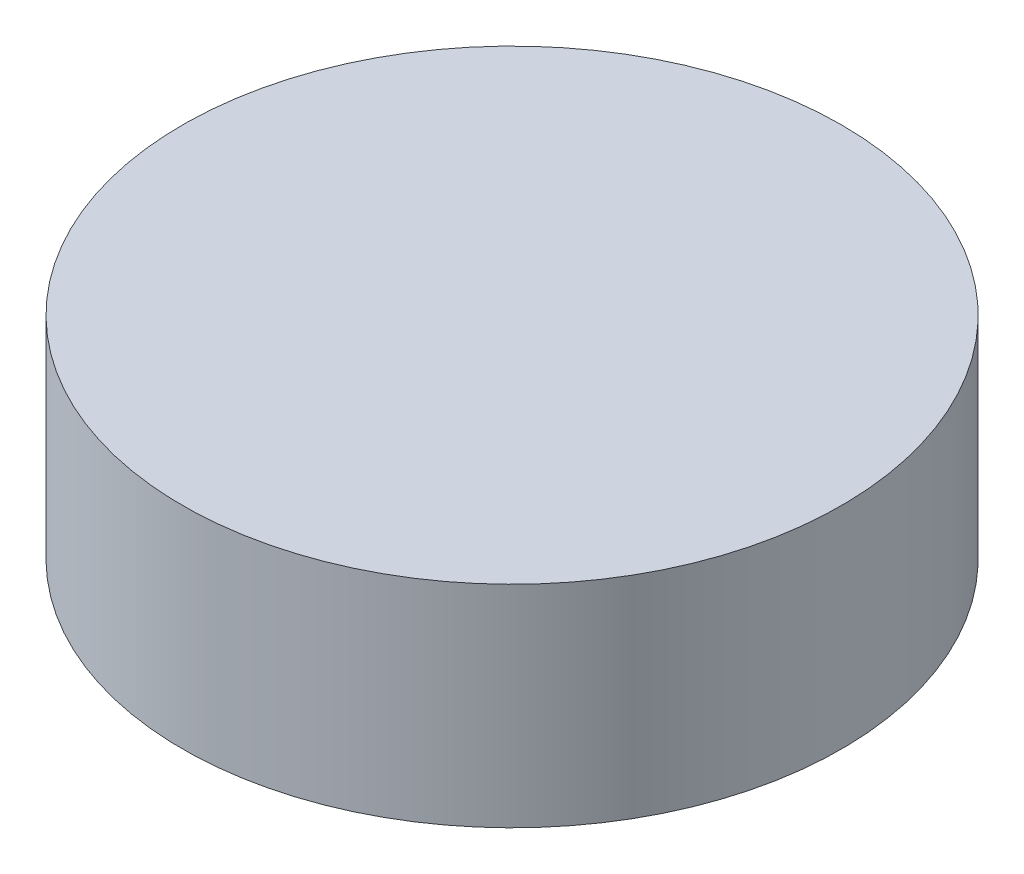
ISO-10303-21;
HEADER;
FILE_DESCRIPTION(('STEP AP214'),'2;1');
FILE_NAME('part.step','',(''),(''),'','','');
FILE_SCHEMA(('AUTOMOTIVE_DESIGN { 1 0 10303 214 1 1 1 1 }'));
ENDSEC;
DATA;
#1=APPLICATION_CONTEXT('core data for automotive mechanical design processes');
#2=APPLICATION_PROTOCOL_DEFINITION('international standard','automotive_design',2000,#1);
#3=PRODUCT_CONTEXT('',#1,'mechanical');
#4=PRODUCT('Part','Part','',(#3));
#5=PRODUCT_RELATED_PRODUCT_CATEGORY('part','',(#4));
#6=PRODUCT_DEFINITION_FORMATION('','',#4);
#7=PRODUCT_DEFINITION_CONTEXT('part definition',#1,'design');
#8=PRODUCT_DEFINITION('design','',#6,#7);
#9=PRODUCT_DEFINITION_SHAPE('','',#8);
#10=(LENGTH_UNIT() NAMED_UNIT(*) SI_UNIT(.MILLI.,.METRE.));
#11=(NAMED_UNIT(*) PLANE_ANGLE_UNIT() SI_UNIT($,.RADIAN.));
#12=(NAMED_UNIT(*) SI_UNIT($,.STERADIAN.) SOLID_ANGLE_UNIT());
#13=UNCERTAINTY_MEASURE_WITH_UNIT(LENGTH_MEASURE(1.E-05),#10,'distance_accuracy_value','');
#14=(GEOMETRIC_REPRESENTATION_CONTEXT(3) GLOBAL_UNCERTAINTY_ASSIGNED_CONTEXT((#13)) GLOBAL_UNIT_ASSIGNED_CONTEXT((#10,
#11,#12)) REPRESENTATION_CONTEXT('',''));
#15=CARTESIAN_POINT('',(0.,0.,0.));
#16=DIRECTION('',(0.,0.,1.));
#17=DIRECTION('',(1.,0.,0.));
#18=AXIS2_PLACEMENT_3D('',#15,#16,#17);
#19=CARTESIAN_POINT('',(0.,0.64,0.));
#20=DIRECTION('',(0.,1.,0.));
#21=DIRECTION('',(0.,0.,1.));
#22=AXIS2_PLACEMENT_3D('',#19,#20,#21);
#23=PLANE('',#22);
#24=CARTESIAN_POINT('',(0.,0.64,0.));
#25=DIRECTION('',(0.,-1.,0.));
#26=DIRECTION('',(0.,0.,-1.));
#27=AXIS2_PLACEMENT_3D('',#24,#25,#26);
#28=CIRCLE('',#27,1.);
#29=CARTESIAN_POINT('',(0.,0.64,-1.));
#30=VERTEX_POINT('',#29);
#31=EDGE_CURVE('E18',#30,#30,#28,.T.);
#32=ORIENTED_EDGE('',*,*,#31,.F.);
#33=EDGE_LOOP('',(#32));
#34=FACE_BOUND('',#33,.T.);
#35=ADVANCED_FACE('F15',(#34),#23,.T.);
#36=CARTESIAN_POINT('',(0.,3.468427124746,0.));
#37=DIRECTION('',(0.,-1.,0.));
#38=DIRECTION('',(0.,0.,-1.));
#39=AXIS2_PLACEMENT_3D('',#36,#37,#38);
#40=CYLINDRICAL_SURFACE('',#39,1.);
#41=ORIENTED_EDGE('',*,*,#31,.T.);
#42=EDGE_LOOP('',(#41));
#43=FACE_BOUND('',#42,.T.);
#44=CARTESIAN_POINT('',(0.,0.,0.));
#45=DIRECTION('',(0.,-1.,0.));
#46=DIRECTION('',(0.,0.,-1.));
#47=AXIS2_PLACEMENT_3D('',#44,#45,#46);
#48=CIRCLE('',#47,1.);
#49=CARTESIAN_POINT('',(0.,0.,-1.));
#50=VERTEX_POINT('',#49);
#51=EDGE_CURVE('E10',#50,#50,#48,.F.);
#52=ORIENTED_EDGE('',*,*,#51,.T.);
#53=EDGE_LOOP('',(#52));
#54=FACE_BOUND('',#53,.T.);
#55=ADVANCED_FACE('F27',(#43,#54),#40,.T.);
#56=CARTESIAN_POINT('',(0.,0.,0.));
#57=DIRECTION('',(0.,1.,0.));
#58=DIRECTION('',(0.,0.,1.));
#59=AXIS2_PLACEMENT_3D('',#56,#57,#58);
#60=PLANE('',#59);
#61=ORIENTED_EDGE('',*,*,#51,.F.);
#62=EDGE_LOOP('',(#61));
#63=FACE_BOUND('',#62,.T.);
#64=ADVANCED_FACE('F34',(#63),#60,.F.);
#65=CLOSED_SHELL('',(#35,#55,#64));
#66=MANIFOLD_SOLID_BREP('B1',#65);
#67=ADVANCED_BREP_SHAPE_REPRESENTATION('',(#18,#66),#14);
#68=SHAPE_DEFINITION_REPRESENTATION(#9,#67);
ENDSEC;
END-ISO-10303-21;
